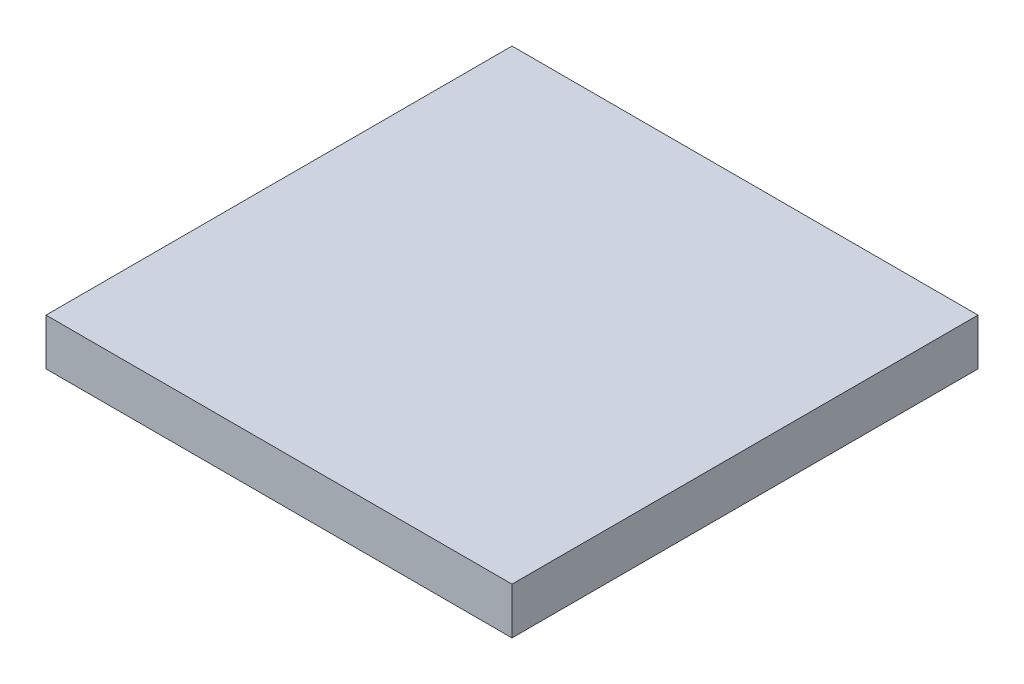
ISO-10303-21;
HEADER;
FILE_DESCRIPTION(('STEP AP214'),'2;1');
FILE_NAME('part.step','',(''),(''),'','','');
FILE_SCHEMA(('AUTOMOTIVE_DESIGN { 1 0 10303 214 1 1 1 1 }'));
ENDSEC;
DATA;
#1=APPLICATION_CONTEXT('core data for automotive mechanical design processes');
#2=APPLICATION_PROTOCOL_DEFINITION('international standard','automotive_design',2000,#1);
#3=PRODUCT_CONTEXT('',#1,'mechanical');
#4=PRODUCT('Part','Part','',(#3));
#5=PRODUCT_RELATED_PRODUCT_CATEGORY('part','',(#4));
#6=PRODUCT_DEFINITION_FORMATION('','',#4);
#7=PRODUCT_DEFINITION_CONTEXT('part definition',#1,'design');
#8=PRODUCT_DEFINITION('design','',#6,#7);
#9=PRODUCT_DEFINITION_SHAPE('','',#8);
#10=(LENGTH_UNIT() NAMED_UNIT(*) SI_UNIT(.MILLI.,.METRE.));
#11=(NAMED_UNIT(*) PLANE_ANGLE_UNIT() SI_UNIT($,.RADIAN.));
#12=(NAMED_UNIT(*) SI_UNIT($,.STERADIAN.) SOLID_ANGLE_UNIT());
#13=UNCERTAINTY_MEASURE_WITH_UNIT(LENGTH_MEASURE(1.E-05),#10,'distance_accuracy_value','');
#14=(GEOMETRIC_REPRESENTATION_CONTEXT(3) GLOBAL_UNCERTAINTY_ASSIGNED_CONTEXT((#13)) GLOBAL_UNIT_ASSIGNED_CONTEXT((#10,
#11,#12)) REPRESENTATION_CONTEXT('',''));
#15=CARTESIAN_POINT('',(0.,0.,0.));
#16=DIRECTION('',(0.,0.,1.));
#17=DIRECTION('',(1.,0.,0.));
#18=AXIS2_PLACEMENT_3D('',#15,#16,#17);
#19=CARTESIAN_POINT('',(50.,10.,-35.));
#20=DIRECTION('',(-1.,0.,0.));
#21=DIRECTION('',(0.,0.,1.));
#22=AXIS2_PLACEMENT_3D('',#19,#20,#21);
#23=PLANE('',#22);
#24=DIRECTION('',(0.,0.,-1.));
#25=VECTOR('',#24,1.);
#26=CARTESIAN_POINT('',(50.,0.,-35.));
#27=LINE('',#26,#25);
#28=CARTESIAN_POINT('',(50.,0.,65.));
#29=VERTEX_POINT('',#28);
#30=CARTESIAN_POINT('',(50.,0.,-35.));
#31=VERTEX_POINT('',#30);
#32=EDGE_CURVE('E73',#29,#31,#27,.T.);
#33=ORIENTED_EDGE('',*,*,#32,.T.);
#34=DIRECTION('',(0.,-1.,0.));
#35=VECTOR('',#34,1.);
#36=CARTESIAN_POINT('',(50.,10.,-35.));
#37=LINE('',#36,#35);
#38=CARTESIAN_POINT('',(50.,10.,-35.));
#39=VERTEX_POINT('',#38);
#40=EDGE_CURVE('E11',#39,#31,#37,.T.);
#41=ORIENTED_EDGE('',*,*,#40,.F.);
#42=DIRECTION('',(0.,0.,-1.));
#43=VECTOR('',#42,1.);
#44=CARTESIAN_POINT('',(50.,10.,0.));
#45=LINE('',#44,#43);
#46=CARTESIAN_POINT('',(50.,10.,65.));
#47=VERTEX_POINT('',#46);
#48=EDGE_CURVE('E78',#47,#39,#45,.T.);
#49=ORIENTED_EDGE('',*,*,#48,.F.);
#50=DIRECTION('',(0.,-1.,0.));
#51=VECTOR('',#50,1.);
#52=CARTESIAN_POINT('',(50.,10.,65.));
#53=LINE('',#52,#51);
#54=EDGE_CURVE('E94',#47,#29,#53,.T.);
#55=ORIENTED_EDGE('',*,*,#54,.T.);
#56=EDGE_LOOP('',(#33,#41,#49,#55));
#57=FACE_BOUND('',#56,.T.);
#58=ADVANCED_FACE('F34',(#57),#23,.F.);
#59=CARTESIAN_POINT('',(-50.,10.,-35.));
#60=DIRECTION('',(0.,0.,1.));
#61=DIRECTION('',(1.,0.,0.));
#62=AXIS2_PLACEMENT_3D('',#59,#60,#61);
#63=PLANE('',#62);
#64=DIRECTION('',(-1.,0.,0.));
#65=VECTOR('',#64,1.);
#66=CARTESIAN_POINT('',(-50.,0.,-35.));
#67=LINE('',#66,#65);
#68=CARTESIAN_POINT('',(-50.,0.,-35.));
#69=VERTEX_POINT('',#68);
#70=EDGE_CURVE('E90',#31,#69,#67,.T.);
#71=ORIENTED_EDGE('',*,*,#70,.T.);
#72=DIRECTION('',(0.,-1.,0.));
#73=VECTOR('',#72,1.);
#74=CARTESIAN_POINT('',(-50.,10.,-35.));
#75=LINE('',#74,#73);
#76=CARTESIAN_POINT('',(-50.,10.,-35.));
#77=VERTEX_POINT('',#76);
#78=EDGE_CURVE('E42',#77,#69,#75,.T.);
#79=ORIENTED_EDGE('',*,*,#78,.F.);
#80=DIRECTION('',(-1.,0.,0.));
#81=VECTOR('',#80,1.);
#82=CARTESIAN_POINT('',(-50.,10.,-35.));
#83=LINE('',#82,#81);
#84=EDGE_CURVE('E81',#39,#77,#83,.T.);
#85=ORIENTED_EDGE('',*,*,#84,.F.);
#86=ORIENTED_EDGE('',*,*,#40,.T.);
#87=EDGE_LOOP('',(#71,#79,#85,#86));
#88=FACE_BOUND('',#87,.T.);
#89=ADVANCED_FACE('F89',(#88),#63,.F.);
#90=CARTESIAN_POINT('',(-50.,10.,65.));
#91=DIRECTION('',(1.,0.,0.));
#92=DIRECTION('',(0.,0.,-1.));
#93=AXIS2_PLACEMENT_3D('',#90,#91,#92);
#94=PLANE('',#93);
#95=DIRECTION('',(0.,0.,1.));
#96=VECTOR('',#95,1.);
#97=CARTESIAN_POINT('',(-50.,0.,65.));
#98=LINE('',#97,#96);
#99=CARTESIAN_POINT('',(-50.,0.,65.));
#100=VERTEX_POINT('',#99);
#101=EDGE_CURVE('E66',#69,#100,#98,.T.);
#102=ORIENTED_EDGE('',*,*,#101,.T.);
#103=DIRECTION('',(0.,-1.,0.));
#104=VECTOR('',#103,1.);
#105=CARTESIAN_POINT('',(-50.,10.,65.));
#106=LINE('',#105,#104);
#107=CARTESIAN_POINT('',(-50.,10.,65.));
#108=VERTEX_POINT('',#107);
#109=EDGE_CURVE('E91',#108,#100,#106,.T.);
#110=ORIENTED_EDGE('',*,*,#109,.F.);
#111=DIRECTION('',(0.,0.,1.));
#112=VECTOR('',#111,1.);
#113=CARTESIAN_POINT('',(-50.,10.,0.));
#114=LINE('',#113,#112);
#115=EDGE_CURVE('E85',#77,#108,#114,.T.);
#116=ORIENTED_EDGE('',*,*,#115,.F.);
#117=ORIENTED_EDGE('',*,*,#78,.T.);
#118=EDGE_LOOP('',(#102,#110,#116,#117));
#119=FACE_BOUND('',#118,.T.);
#120=ADVANCED_FACE('F92',(#119),#94,.F.);
#121=CARTESIAN_POINT('',(-50.,10.,65.));
#122=DIRECTION('',(0.,0.,-1.));
#123=DIRECTION('',(-1.,0.,0.));
#124=AXIS2_PLACEMENT_3D('',#121,#122,#123);
#125=PLANE('',#124);
#126=DIRECTION('',(1.,0.,0.));
#127=VECTOR('',#126,1.);
#128=CARTESIAN_POINT('',(-50.,0.,65.));
#129=LINE('',#128,#127);
#130=EDGE_CURVE('E102',#100,#29,#129,.T.);
#131=ORIENTED_EDGE('',*,*,#130,.T.);
#132=ORIENTED_EDGE('',*,*,#54,.F.);
#133=DIRECTION('',(1.,0.,0.));
#134=VECTOR('',#133,1.);
#135=CARTESIAN_POINT('',(-50.,10.,65.));
#136=LINE('',#135,#134);
#137=EDGE_CURVE('E50',#108,#47,#136,.T.);
#138=ORIENTED_EDGE('',*,*,#137,.F.);
#139=ORIENTED_EDGE('',*,*,#109,.T.);
#140=EDGE_LOOP('',(#131,#132,#138,#139));
#141=FACE_BOUND('',#140,.T.);
#142=ADVANCED_FACE('F107',(#141),#125,.F.);
#143=CARTESIAN_POINT('',(0.,10.,0.));
#144=DIRECTION('',(0.,1.,0.));
#145=DIRECTION('',(0.,0.,1.));
#146=AXIS2_PLACEMENT_3D('',#143,#144,#145);
#147=PLANE('',#146);
#148=ORIENTED_EDGE('',*,*,#48,.T.);
#149=ORIENTED_EDGE('',*,*,#84,.T.);
#150=ORIENTED_EDGE('',*,*,#115,.T.);
#151=ORIENTED_EDGE('',*,*,#137,.T.);
#152=EDGE_LOOP('',(#148,#149,#150,#151));
#153=FACE_BOUND('',#152,.T.);
#154=ADVANCED_FACE('F83',(#153),#147,.T.);
#155=CARTESIAN_POINT('',(0.,0.,0.));
#156=DIRECTION('',(0.,1.,0.));
#157=DIRECTION('',(0.,0.,1.));
#158=AXIS2_PLACEMENT_3D('',#155,#156,#157);
#159=PLANE('',#158);
#160=CARTESIAN_POINT('',(0.,0.,0.));
#161=DIRECTION('',(0.,1.,0.));
#162=DIRECTION('',(0.,0.,1.));
#163=AXIS2_PLACEMENT_3D('',#160,#161,#162);
#164=CIRCLE('',#163,1.);
#165=CARTESIAN_POINT('',(0.,0.,1.));
#166=VERTEX_POINT('',#165);
#167=EDGE_CURVE('E129',#166,#166,#164,.T.);
#168=ORIENTED_EDGE('',*,*,#167,.T.);
#169=EDGE_LOOP('',(#168));
#170=FACE_BOUND('',#169,.T.);
#171=ORIENTED_EDGE('',*,*,#32,.F.);
#172=ORIENTED_EDGE('',*,*,#130,.F.);
#173=ORIENTED_EDGE('',*,*,#101,.F.);
#174=ORIENTED_EDGE('',*,*,#70,.F.);
#175=EDGE_LOOP('',(#171,#172,#173,#174));
#176=FACE_BOUND('',#175,.T.);
#177=ADVANCED_FACE('F108',(#170,#176),#159,.F.);
#178=CARTESIAN_POINT('',(0.,0.0001,0.));
#179=DIRECTION('',(0.,-1.,0.));
#180=DIRECTION('',(0.,0.,-1.));
#181=AXIS2_PLACEMENT_3D('',#178,#179,#180);
#182=CYLINDRICAL_SURFACE('',#181,1.);
#183=CARTESIAN_POINT('',(0.,0.0001,0.));
#184=DIRECTION('',(0.,1.,0.));
#185=DIRECTION('',(0.,0.,1.));
#186=AXIS2_PLACEMENT_3D('',#183,#184,#185);
#187=CIRCLE('',#186,1.);
#188=CARTESIAN_POINT('',(0.,0.0001,1.));
#189=VERTEX_POINT('',#188);
#190=EDGE_CURVE('E99',#189,#189,#187,.T.);
#191=ORIENTED_EDGE('',*,*,#190,.T.);
#192=EDGE_LOOP('',(#191));
#193=FACE_BOUND('',#192,.T.);
#194=ORIENTED_EDGE('',*,*,#167,.F.);
#195=EDGE_LOOP('',(#194));
#196=FACE_BOUND('',#195,.T.);
#197=ADVANCED_FACE('F110',(#193,#196),#182,.F.);
#198=CARTESIAN_POINT('',(0.,0.0001,0.));
#199=DIRECTION('',(0.,1.,0.));
#200=DIRECTION('',(0.,0.,1.));
#201=AXIS2_PLACEMENT_3D('',#198,#199,#200);
#202=PLANE('',#201);
#203=ORIENTED_EDGE('',*,*,#190,.F.);
#204=EDGE_LOOP('',(#203));
#205=FACE_BOUND('',#204,.T.);
#206=ADVANCED_FACE('F117',(#205),#202,.F.);
#207=CLOSED_SHELL('',(#58,#89,#120,#142,#154,#177,#197,#206));
#208=MANIFOLD_SOLID_BREP('B2',#207);
#209=ADVANCED_BREP_SHAPE_REPRESENTATION('',(#18,#208),#14);
#210=SHAPE_DEFINITION_REPRESENTATION(#9,#209);
ENDSEC;
END-ISO-10303-21;
